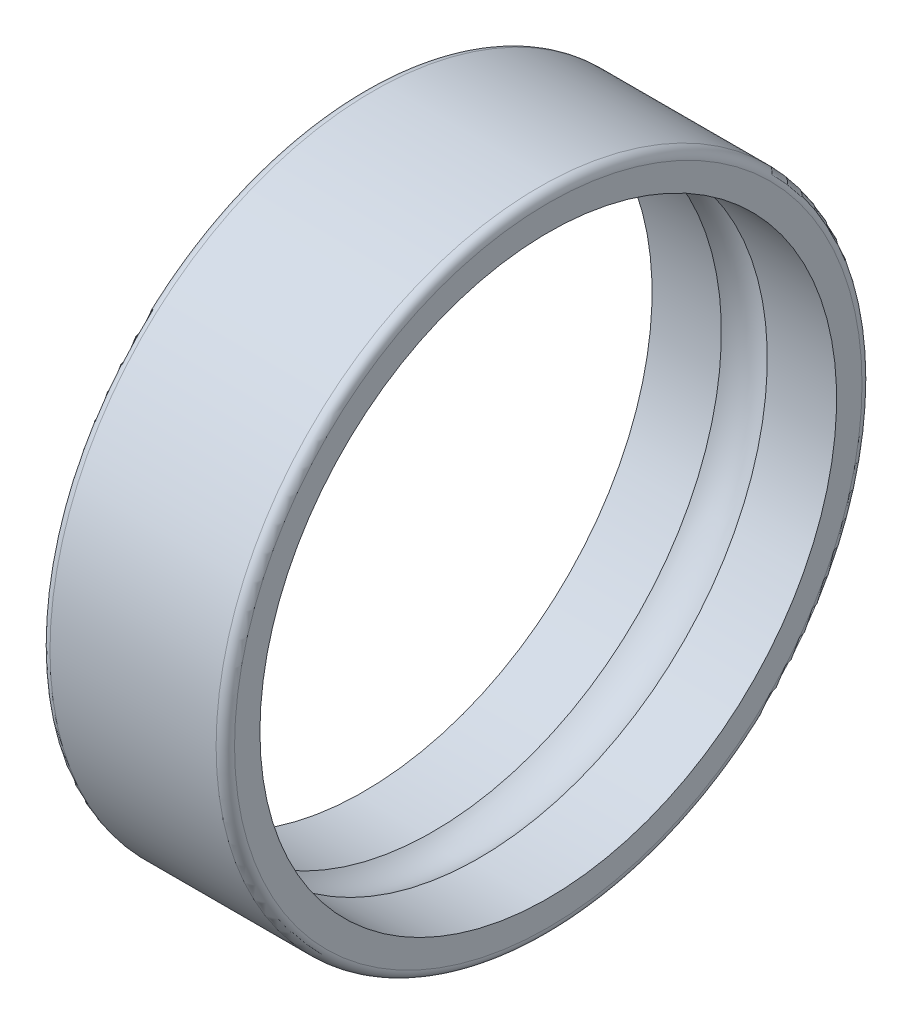
ISO-10303-21;
HEADER;
FILE_DESCRIPTION(('STEP AP214'),'2;1');
FILE_NAME('part.step','',(''),(''),'','','');
FILE_SCHEMA(('AUTOMOTIVE_DESIGN { 1 0 10303 214 1 1 1 1 }'));
ENDSEC;
DATA;
#1=APPLICATION_CONTEXT('core data for automotive mechanical design processes');
#2=APPLICATION_PROTOCOL_DEFINITION('international standard','automotive_design',2000,#1);
#3=PRODUCT_CONTEXT('',#1,'mechanical');
#4=PRODUCT('Part','Part','',(#3));
#5=PRODUCT_RELATED_PRODUCT_CATEGORY('part','',(#4));
#6=PRODUCT_DEFINITION_FORMATION('','',#4);
#7=PRODUCT_DEFINITION_CONTEXT('part definition',#1,'design');
#8=PRODUCT_DEFINITION('design','',#6,#7);
#9=PRODUCT_DEFINITION_SHAPE('','',#8);
#10=(LENGTH_UNIT() NAMED_UNIT(*) SI_UNIT(.MILLI.,.METRE.));
#11=(NAMED_UNIT(*) PLANE_ANGLE_UNIT() SI_UNIT($,.RADIAN.));
#12=(NAMED_UNIT(*) SI_UNIT($,.STERADIAN.) SOLID_ANGLE_UNIT());
#13=UNCERTAINTY_MEASURE_WITH_UNIT(LENGTH_MEASURE(1.E-05),#10,'distance_accuracy_value','');
#14=(GEOMETRIC_REPRESENTATION_CONTEXT(3) GLOBAL_UNCERTAINTY_ASSIGNED_CONTEXT((#13)) GLOBAL_UNIT_ASSIGNED_CONTEXT((#10,
#11,#12)) REPRESENTATION_CONTEXT('',''));
#15=CARTESIAN_POINT('',(0.,0.,0.));
#16=DIRECTION('',(0.,0.,1.));
#17=DIRECTION('',(1.,0.,0.));
#18=AXIS2_PLACEMENT_3D('',#15,#16,#17);
#19=CARTESIAN_POINT('',(0.0999999999999236,0.,0.));
#20=DIRECTION('',(-1.,0.,0.));
#21=DIRECTION('',(0.,0.,1.));
#22=AXIS2_PLACEMENT_3D('',#19,#20,#21);
#23=TOROIDAL_SURFACE('',#22,3.40000000000008,0.0999999999999236);
#24=CARTESIAN_POINT('',(0.,0.,0.));
#25=DIRECTION('',(-1.,0.,0.));
#26=DIRECTION('',(0.,0.,1.));
#27=AXIS2_PLACEMENT_3D('',#24,#25,#26);
#28=CIRCLE('',#27,3.4);
#29=CARTESIAN_POINT('',(0.,0.,3.4));
#30=VERTEX_POINT('',#29);
#31=EDGE_CURVE('E10',#30,#30,#28,.T.);
#32=ORIENTED_EDGE('',*,*,#31,.F.);
#33=EDGE_LOOP('',(#32));
#34=FACE_BOUND('',#33,.T.);
#35=CARTESIAN_POINT('',(0.1,0.,0.));
#36=DIRECTION('',(-1.,0.,0.));
#37=DIRECTION('',(0.,0.,1.));
#38=AXIS2_PLACEMENT_3D('',#35,#36,#37);
#39=CIRCLE('',#38,3.5);
#40=CARTESIAN_POINT('',(0.1,0.,3.5));
#41=VERTEX_POINT('',#40);
#42=EDGE_CURVE('E57',#41,#41,#39,.T.);
#43=ORIENTED_EDGE('',*,*,#42,.T.);
#44=EDGE_LOOP('',(#43));
#45=FACE_BOUND('',#44,.T.);
#46=ADVANCED_FACE('F29',(#34,#45),#23,.T.);
#47=CARTESIAN_POINT('',(0.,3.4,0.));
#48=DIRECTION('',(1.,0.,0.));
#49=DIRECTION('',(0.,0.,-1.));
#50=AXIS2_PLACEMENT_3D('',#47,#48,#49);
#51=PLANE('',#50);
#52=CARTESIAN_POINT('',(0.,0.,0.));
#53=DIRECTION('',(-1.,0.,0.));
#54=DIRECTION('',(0.,0.,1.));
#55=AXIS2_PLACEMENT_3D('',#52,#53,#54);
#56=CIRCLE('',#55,3.125);
#57=CARTESIAN_POINT('',(0.,0.,3.125));
#58=VERTEX_POINT('',#57);
#59=EDGE_CURVE('E35',#58,#58,#56,.T.);
#60=ORIENTED_EDGE('',*,*,#59,.F.);
#61=EDGE_LOOP('',(#60));
#62=FACE_BOUND('',#61,.T.);
#63=ORIENTED_EDGE('',*,*,#31,.T.);
#64=EDGE_LOOP('',(#63));
#65=FACE_BOUND('',#64,.T.);
#66=ADVANCED_FACE('F94',(#62,#65),#51,.F.);
#67=CARTESIAN_POINT('',(2.,0.,0.));
#68=DIRECTION('',(-1.,0.,0.));
#69=DIRECTION('',(0.,0.,1.));
#70=AXIS2_PLACEMENT_3D('',#67,#68,#69);
#71=CYLINDRICAL_SURFACE('',#70,3.125);
#72=CARTESIAN_POINT('',(0.75125314072335,0.,0.));
#73=DIRECTION('',(-1.,0.,0.));
#74=DIRECTION('',(0.,0.,1.));
#75=AXIS2_PLACEMENT_3D('',#72,#73,#74);
#76=CIRCLE('',#75,3.125);
#77=CARTESIAN_POINT('',(0.75125314072335,0.,3.125));
#78=VERTEX_POINT('',#77);
#79=EDGE_CURVE('E39',#78,#78,#76,.T.);
#80=ORIENTED_EDGE('',*,*,#79,.F.);
#81=EDGE_LOOP('',(#80));
#82=FACE_BOUND('',#81,.T.);
#83=ORIENTED_EDGE('',*,*,#59,.T.);
#84=EDGE_LOOP('',(#83));
#85=FACE_BOUND('',#84,.T.);
#86=ADVANCED_FACE('F89',(#82,#85),#71,.F.);
#87=CARTESIAN_POINT('',(1.00000000000002,0.,0.));
#88=DIRECTION('',(-1.,0.,0.));
#89=DIRECTION('',(0.,0.,1.));
#90=AXIS2_PLACEMENT_3D('',#87,#88,#89);
#91=TOROIDAL_SURFACE('',#90,2.74999999999993,0.450000000000066);
#92=CARTESIAN_POINT('',(1.2487468592767,0.,0.));
#93=DIRECTION('',(-1.,0.,0.));
#94=DIRECTION('',(0.,0.,1.));
#95=AXIS2_PLACEMENT_3D('',#92,#93,#94);
#96=CIRCLE('',#95,3.125);
#97=CARTESIAN_POINT('',(1.2487468592767,0.,3.125));
#98=VERTEX_POINT('',#97);
#99=EDGE_CURVE('E43',#98,#98,#96,.T.);
#100=ORIENTED_EDGE('',*,*,#99,.F.);
#101=EDGE_LOOP('',(#100));
#102=FACE_BOUND('',#101,.T.);
#103=ORIENTED_EDGE('',*,*,#79,.T.);
#104=EDGE_LOOP('',(#103));
#105=FACE_BOUND('',#104,.T.);
#106=ADVANCED_FACE('F83',(#102,#105),#91,.F.);
#107=CARTESIAN_POINT('',(2.,0.,0.));
#108=DIRECTION('',(-1.,0.,0.));
#109=DIRECTION('',(0.,0.,1.));
#110=AXIS2_PLACEMENT_3D('',#107,#108,#109);
#111=CYLINDRICAL_SURFACE('',#110,3.125);
#112=CARTESIAN_POINT('',(2.,0.,0.));
#113=DIRECTION('',(-1.,0.,0.));
#114=DIRECTION('',(0.,0.,1.));
#115=AXIS2_PLACEMENT_3D('',#112,#113,#114);
#116=CIRCLE('',#115,3.125);
#117=CARTESIAN_POINT('',(2.,0.,3.125));
#118=VERTEX_POINT('',#117);
#119=EDGE_CURVE('E48',#118,#118,#116,.T.);
#120=ORIENTED_EDGE('',*,*,#119,.F.);
#121=EDGE_LOOP('',(#120));
#122=FACE_BOUND('',#121,.T.);
#123=ORIENTED_EDGE('',*,*,#99,.T.);
#124=EDGE_LOOP('',(#123));
#125=FACE_BOUND('',#124,.T.);
#126=ADVANCED_FACE('F77',(#122,#125),#111,.F.);
#127=CARTESIAN_POINT('',(2.,3.125,0.));
#128=DIRECTION('',(-1.,0.,0.));
#129=DIRECTION('',(0.,0.,1.));
#130=AXIS2_PLACEMENT_3D('',#127,#128,#129);
#131=PLANE('',#130);
#132=CARTESIAN_POINT('',(2.,0.,0.));
#133=DIRECTION('',(-1.,0.,0.));
#134=DIRECTION('',(0.,0.,1.));
#135=AXIS2_PLACEMENT_3D('',#132,#133,#134);
#136=CIRCLE('',#135,3.4);
#137=CARTESIAN_POINT('',(2.,0.,3.4));
#138=VERTEX_POINT('',#137);
#139=EDGE_CURVE('E51',#138,#138,#136,.T.);
#140=ORIENTED_EDGE('',*,*,#139,.F.);
#141=EDGE_LOOP('',(#140));
#142=FACE_BOUND('',#141,.T.);
#143=ORIENTED_EDGE('',*,*,#119,.T.);
#144=EDGE_LOOP('',(#143));
#145=FACE_BOUND('',#144,.T.);
#146=ADVANCED_FACE('F71',(#142,#145),#131,.F.);
#147=CARTESIAN_POINT('',(1.90000000000015,0.,0.));
#148=DIRECTION('',(-1.,0.,0.));
#149=DIRECTION('',(0.,0.,1.));
#150=AXIS2_PLACEMENT_3D('',#147,#148,#149);
#151=TOROIDAL_SURFACE('',#150,3.40000000000015,0.0999999999998451);
#152=CARTESIAN_POINT('',(1.9,0.,0.));
#153=DIRECTION('',(-1.,0.,0.));
#154=DIRECTION('',(0.,0.,1.));
#155=AXIS2_PLACEMENT_3D('',#152,#153,#154);
#156=CIRCLE('',#155,3.5);
#157=CARTESIAN_POINT('',(1.9,0.,3.5));
#158=VERTEX_POINT('',#157);
#159=EDGE_CURVE('E54',#158,#158,#156,.T.);
#160=ORIENTED_EDGE('',*,*,#159,.F.);
#161=EDGE_LOOP('',(#160));
#162=FACE_BOUND('',#161,.T.);
#163=ORIENTED_EDGE('',*,*,#139,.T.);
#164=EDGE_LOOP('',(#163));
#165=FACE_BOUND('',#164,.T.);
#166=ADVANCED_FACE('F65',(#162,#165),#151,.T.);
#167=CARTESIAN_POINT('',(2.,0.,0.));
#168=DIRECTION('',(-1.,0.,0.));
#169=DIRECTION('',(0.,0.,1.));
#170=AXIS2_PLACEMENT_3D('',#167,#168,#169);
#171=CYLINDRICAL_SURFACE('',#170,3.5);
#172=ORIENTED_EDGE('',*,*,#42,.F.);
#173=EDGE_LOOP('',(#172));
#174=FACE_BOUND('',#173,.T.);
#175=ORIENTED_EDGE('',*,*,#159,.T.);
#176=EDGE_LOOP('',(#175));
#177=FACE_BOUND('',#176,.T.);
#178=ADVANCED_FACE('F62',(#174,#177),#171,.T.);
#179=CLOSED_SHELL('',(#46,#66,#86,#106,#126,#146,#166,#178));
#180=MANIFOLD_SOLID_BREP('B2',#179);
#181=ADVANCED_BREP_SHAPE_REPRESENTATION('',(#18,#180),#14);
#182=SHAPE_DEFINITION_REPRESENTATION(#9,#181);
ENDSEC;
END-ISO-10303-21;
